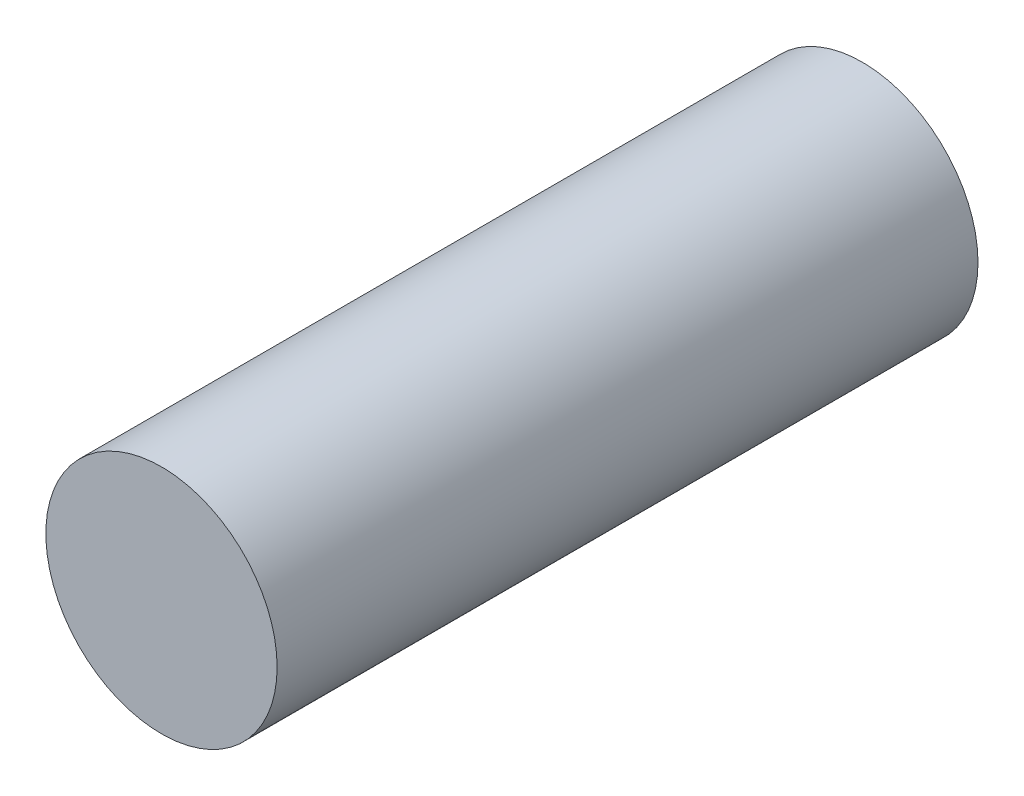
ISO-10303-21;
HEADER;
FILE_DESCRIPTION(('STEP AP214'),'2;1');
FILE_NAME('part.step','',(''),(''),'','','');
FILE_SCHEMA(('AUTOMOTIVE_DESIGN { 1 0 10303 214 1 1 1 1 }'));
ENDSEC;
DATA;
#1=APPLICATION_CONTEXT('core data for automotive mechanical design processes');
#2=APPLICATION_PROTOCOL_DEFINITION('international standard','automotive_design',2000,#1);
#3=PRODUCT_CONTEXT('',#1,'mechanical');
#4=PRODUCT('Part','Part','',(#3));
#5=PRODUCT_RELATED_PRODUCT_CATEGORY('part','',(#4));
#6=PRODUCT_DEFINITION_FORMATION('','',#4);
#7=PRODUCT_DEFINITION_CONTEXT('part definition',#1,'design');
#8=PRODUCT_DEFINITION('design','',#6,#7);
#9=PRODUCT_DEFINITION_SHAPE('','',#8);
#10=(LENGTH_UNIT() NAMED_UNIT(*) SI_UNIT(.MILLI.,.METRE.));
#11=(NAMED_UNIT(*) PLANE_ANGLE_UNIT() SI_UNIT($,.RADIAN.));
#12=(NAMED_UNIT(*) SI_UNIT($,.STERADIAN.) SOLID_ANGLE_UNIT());
#13=UNCERTAINTY_MEASURE_WITH_UNIT(LENGTH_MEASURE(1.E-05),#10,'distance_accuracy_value','');
#14=(GEOMETRIC_REPRESENTATION_CONTEXT(3) GLOBAL_UNCERTAINTY_ASSIGNED_CONTEXT((#13)) GLOBAL_UNIT_ASSIGNED_CONTEXT((#10,
#11,#12)) REPRESENTATION_CONTEXT('',''));
#15=CARTESIAN_POINT('',(0.,0.,0.));
#16=DIRECTION('',(0.,0.,1.));
#17=DIRECTION('',(1.,0.,0.));
#18=AXIS2_PLACEMENT_3D('',#15,#16,#17);
#19=CARTESIAN_POINT('',(0.,0.,10.));
#20=DIRECTION('',(0.,0.,-1.));
#21=DIRECTION('',(-1.,0.,0.));
#22=AXIS2_PLACEMENT_3D('',#19,#20,#21);
#23=CYLINDRICAL_SURFACE('',#22,1.65);
#24=CARTESIAN_POINT('',(0.,0.,10.));
#25=DIRECTION('',(0.,0.,1.));
#26=DIRECTION('',(1.,0.,0.));
#27=AXIS2_PLACEMENT_3D('',#24,#25,#26);
#28=CIRCLE('',#27,1.65);
#29=CARTESIAN_POINT('',(1.65,0.,10.));
#30=VERTEX_POINT('',#29);
#31=EDGE_CURVE('E10',#30,#30,#28,.T.);
#32=ORIENTED_EDGE('',*,*,#31,.F.);
#33=EDGE_LOOP('',(#32));
#34=FACE_BOUND('',#33,.T.);
#35=CARTESIAN_POINT('',(0.,0.,0.));
#36=DIRECTION('',(0.,0.,1.));
#37=DIRECTION('',(1.,0.,0.));
#38=AXIS2_PLACEMENT_3D('',#35,#36,#37);
#39=CIRCLE('',#38,1.65);
#40=CARTESIAN_POINT('',(1.65,0.,0.));
#41=VERTEX_POINT('',#40);
#42=EDGE_CURVE('E33',#41,#41,#39,.T.);
#43=ORIENTED_EDGE('',*,*,#42,.T.);
#44=EDGE_LOOP('',(#43));
#45=FACE_BOUND('',#44,.T.);
#46=ADVANCED_FACE('F30',(#34,#45),#23,.T.);
#47=CARTESIAN_POINT('',(0.,0.,10.));
#48=DIRECTION('',(0.,0.,1.));
#49=DIRECTION('',(1.,0.,0.));
#50=AXIS2_PLACEMENT_3D('',#47,#48,#49);
#51=PLANE('',#50);
#52=ORIENTED_EDGE('',*,*,#31,.T.);
#53=EDGE_LOOP('',(#52));
#54=FACE_BOUND('',#53,.T.);
#55=ADVANCED_FACE('F45',(#54),#51,.T.);
#56=CARTESIAN_POINT('',(0.,0.,0.));
#57=DIRECTION('',(0.,0.,1.));
#58=DIRECTION('',(1.,0.,0.));
#59=AXIS2_PLACEMENT_3D('',#56,#57,#58);
#60=PLANE('',#59);
#61=ORIENTED_EDGE('',*,*,#42,.F.);
#62=EDGE_LOOP('',(#61));
#63=FACE_BOUND('',#62,.T.);
#64=ADVANCED_FACE('F43',(#63),#60,.F.);
#65=CLOSED_SHELL('',(#46,#55,#64));
#66=MANIFOLD_SOLID_BREP('B2',#65);
#67=ADVANCED_BREP_SHAPE_REPRESENTATION('',(#18,#66),#14);
#68=SHAPE_DEFINITION_REPRESENTATION(#9,#67);
ENDSEC;
END-ISO-10303-21;
